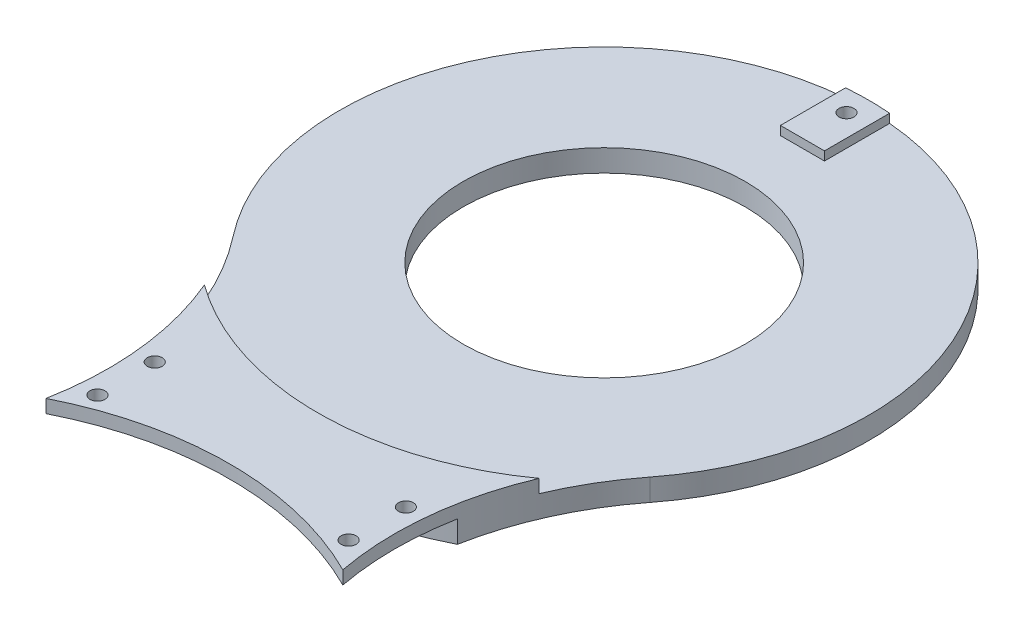
ISO-10303-21;
HEADER;
FILE_DESCRIPTION(('STEP AP214'),'2;1');
FILE_NAME('part.step','',(''),(''),'','','');
FILE_SCHEMA(('AUTOMOTIVE_DESIGN { 1 0 10303 214 1 1 1 1 }'));
ENDSEC;
DATA;
#1=APPLICATION_CONTEXT('core data for automotive mechanical design processes');
#2=APPLICATION_PROTOCOL_DEFINITION('international standard','automotive_design',2000,#1);
#3=PRODUCT_CONTEXT('',#1,'mechanical');
#4=PRODUCT('Part','Part','',(#3));
#5=PRODUCT_RELATED_PRODUCT_CATEGORY('part','',(#4));
#6=PRODUCT_DEFINITION_FORMATION('','',#4);
#7=PRODUCT_DEFINITION_CONTEXT('part definition',#1,'design');
#8=PRODUCT_DEFINITION('design','',#6,#7);
#9=PRODUCT_DEFINITION_SHAPE('','',#8);
#10=(LENGTH_UNIT() NAMED_UNIT(*) SI_UNIT(.MILLI.,.METRE.));
#11=(NAMED_UNIT(*) PLANE_ANGLE_UNIT() SI_UNIT($,.RADIAN.));
#12=(NAMED_UNIT(*) SI_UNIT($,.STERADIAN.) SOLID_ANGLE_UNIT());
#13=UNCERTAINTY_MEASURE_WITH_UNIT(LENGTH_MEASURE(1.E-05),#10,'distance_accuracy_value','');
#14=(GEOMETRIC_REPRESENTATION_CONTEXT(3) GLOBAL_UNCERTAINTY_ASSIGNED_CONTEXT((#13)) GLOBAL_UNIT_ASSIGNED_CONTEXT((#10,
#11,#12)) REPRESENTATION_CONTEXT('',''));
#15=CARTESIAN_POINT('',(0.,0.,0.));
#16=DIRECTION('',(0.,0.,1.));
#17=DIRECTION('',(1.,0.,0.));
#18=AXIS2_PLACEMENT_3D('',#15,#16,#17);
#19=CARTESIAN_POINT('',(51.234753829798,5.,-40.));
#20=DIRECTION('',(0.,1.,0.));
#21=DIRECTION('',(0.,0.,1.));
#22=AXIS2_PLACEMENT_3D('',#19,#20,#21);
#23=PLANE('',#22);
#24=CARTESIAN_POINT('',(0.,5.,-160.));
#25=DIRECTION('',(0.,1.,0.));
#26=DIRECTION('',(0.,0.,1.));
#27=AXIS2_PLACEMENT_3D('',#24,#25,#26);
#28=CIRCLE('',#27,32.);
#29=CARTESIAN_POINT('',(0.,5.,-128.));
#30=VERTEX_POINT('',#29);
#31=EDGE_CURVE('E199',#30,#30,#28,.T.);
#32=ORIENTED_EDGE('',*,*,#31,.F.);
#33=EDGE_LOOP('',(#32));
#34=FACE_BOUND('',#33,.T.);
#35=CARTESIAN_POINT('',(-102.469507659596,5.,-80.));
#36=DIRECTION('',(0.,-1.,0.));
#37=DIRECTION('',(0.,0.,1.));
#38=AXIS2_PLACEMENT_3D('',#35,#36,#37);
#39=CIRCLE('',#38,70.);
#40=CARTESIAN_POINT('',(-47.2936189198135,5.,-123.076923076923));
#41=VERTEX_POINT('',#40);
#42=CARTESIAN_POINT('',(-37.9965134730589,5.,-107.262300354569));
#43=VERTEX_POINT('',#42);
#44=EDGE_CURVE('E211',#41,#43,#39,.T.);
#45=ORIENTED_EDGE('',*,*,#44,.T.);
#46=CARTESIAN_POINT('',(0.,5.,-160.));
#47=DIRECTION('',(0.,-1.,0.));
#48=DIRECTION('',(0.,0.,1.));
#49=AXIS2_PLACEMENT_3D('',#46,#47,#48);
#50=CIRCLE('',#49,65.);
#51=CARTESIAN_POINT('',(37.9965134730589,5.,-107.262300354569));
#52=VERTEX_POINT('',#51);
#53=EDGE_CURVE('E274',#52,#43,#50,.T.);
#54=ORIENTED_EDGE('',*,*,#53,.F.);
#55=CARTESIAN_POINT('',(102.469507659596,5.,-80.));
#56=DIRECTION('',(0.,-1.,0.));
#57=DIRECTION('',(0.,0.,1.));
#58=AXIS2_PLACEMENT_3D('',#55,#56,#57);
#59=CIRCLE('',#58,70.);
#60=CARTESIAN_POINT('',(47.2936189198135,5.,-123.076923076923));
#61=VERTEX_POINT('',#60);
#62=EDGE_CURVE('E205',#52,#61,#59,.T.);
#63=ORIENTED_EDGE('',*,*,#62,.T.);
#64=CARTESIAN_POINT('',(0.,5.,-160.));
#65=DIRECTION('',(0.,1.,0.));
#66=DIRECTION('',(0.,0.,1.));
#67=AXIS2_PLACEMENT_3D('',#64,#65,#66);
#68=CIRCLE('',#67,60.);
#69=CARTESIAN_POINT('',(5.,5.,-219.791303715507));
#70=VERTEX_POINT('',#69);
#71=EDGE_CURVE('E209',#61,#70,#68,.T.);
#72=ORIENTED_EDGE('',*,*,#71,.T.);
#73=DIRECTION('',(0.,0.,-1.));
#74=VECTOR('',#73,1.);
#75=CARTESIAN_POINT('',(5.,5.,-205.));
#76=LINE('',#75,#74);
#77=CARTESIAN_POINT('',(5.,5.,-205.));
#78=VERTEX_POINT('',#77);
#79=EDGE_CURVE('E59',#78,#70,#76,.T.);
#80=ORIENTED_EDGE('',*,*,#79,.F.);
#81=DIRECTION('',(1.,0.,0.));
#82=VECTOR('',#81,1.);
#83=CARTESIAN_POINT('',(5.,5.,-205.));
#84=LINE('',#83,#82);
#85=CARTESIAN_POINT('',(-5.,5.,-205.));
#86=VERTEX_POINT('',#85);
#87=EDGE_CURVE('E175',#86,#78,#84,.T.);
#88=ORIENTED_EDGE('',*,*,#87,.F.);
#89=DIRECTION('',(0.,0.,1.));
#90=VECTOR('',#89,1.);
#91=CARTESIAN_POINT('',(-5.,5.,-205.));
#92=LINE('',#91,#90);
#93=CARTESIAN_POINT('',(-5.,5.,-219.791303715507));
#94=VERTEX_POINT('',#93);
#95=EDGE_CURVE('E183',#94,#86,#92,.T.);
#96=ORIENTED_EDGE('',*,*,#95,.F.);
#97=EDGE_CURVE('E207',#94,#41,#68,.T.);
#98=ORIENTED_EDGE('',*,*,#97,.T.);
#99=EDGE_LOOP('',(#45,#54,#63,#72,#80,#88,#96,#98));
#100=FACE_BOUND('',#99,.T.);
#101=ADVANCED_FACE('F36',(#34,#100),#23,.T.);
#102=CARTESIAN_POINT('',(51.234753829798,0.,-40.));
#103=DIRECTION('',(0.,1.,0.));
#104=DIRECTION('',(0.,0.,1.));
#105=AXIS2_PLACEMENT_3D('',#102,#103,#104);
#106=PLANE('',#105);
#107=CARTESIAN_POINT('',(0.,0.,-160.));
#108=DIRECTION('',(0.,1.,0.));
#109=DIRECTION('',(0.,0.,1.));
#110=AXIS2_PLACEMENT_3D('',#107,#108,#109);
#111=CIRCLE('',#110,32.);
#112=CARTESIAN_POINT('',(0.,0.,-128.));
#113=VERTEX_POINT('',#112);
#114=EDGE_CURVE('E198',#113,#113,#111,.T.);
#115=ORIENTED_EDGE('',*,*,#114,.T.);
#116=EDGE_LOOP('',(#115));
#117=FACE_BOUND('',#116,.T.);
#118=CARTESIAN_POINT('',(0.,0.,-215.));
#119=DIRECTION('',(0.,-1.,0.));
#120=DIRECTION('',(0.,0.,-1.));
#121=AXIS2_PLACEMENT_3D('',#118,#119,#120);
#122=CIRCLE('',#121,2.95);
#123=CARTESIAN_POINT('',(0.,0.,-217.95));
#124=VERTEX_POINT('',#123);
#125=EDGE_CURVE('E161',#124,#124,#122,.T.);
#126=ORIENTED_EDGE('',*,*,#125,.F.);
#127=EDGE_LOOP('',(#126));
#128=FACE_BOUND('',#127,.T.);
#129=CARTESIAN_POINT('',(102.469507659596,0.,-80.));
#130=DIRECTION('',(0.,-1.,0.));
#131=DIRECTION('',(0.,0.,1.));
#132=AXIS2_PLACEMENT_3D('',#129,#130,#131);
#133=CIRCLE('',#132,70.);
#134=CARTESIAN_POINT('',(33.6854203746086,0.,-92.9903555136583));
#135=VERTEX_POINT('',#134);
#136=CARTESIAN_POINT('',(47.2936189198135,0.,-123.076923076923));
#137=VERTEX_POINT('',#136);
#138=EDGE_CURVE('E202',#135,#137,#133,.T.);
#139=ORIENTED_EDGE('',*,*,#138,.F.);
#140=CARTESIAN_POINT('',(0.,0.,-160.));
#141=DIRECTION('',(0.,1.,0.));
#142=DIRECTION('',(0.,0.,-1.));
#143=AXIS2_PLACEMENT_3D('',#140,#141,#142);
#144=CIRCLE('',#143,75.);
#145=CARTESIAN_POINT('',(-33.6854203746086,0.,-92.9903555136583));
#146=VERTEX_POINT('',#145);
#147=EDGE_CURVE('E149',#146,#135,#144,.T.);
#148=ORIENTED_EDGE('',*,*,#147,.F.);
#149=CARTESIAN_POINT('',(-102.469507659596,0.,-80.));
#150=DIRECTION('',(0.,-1.,0.));
#151=DIRECTION('',(0.,0.,1.));
#152=AXIS2_PLACEMENT_3D('',#149,#150,#151);
#153=CIRCLE('',#152,70.);
#154=CARTESIAN_POINT('',(-47.2936189198135,0.,-123.076923076923));
#155=VERTEX_POINT('',#154);
#156=EDGE_CURVE('E208',#155,#146,#153,.T.);
#157=ORIENTED_EDGE('',*,*,#156,.F.);
#158=CARTESIAN_POINT('',(0.,0.,-160.));
#159=DIRECTION('',(0.,1.,0.));
#160=DIRECTION('',(0.,0.,1.));
#161=AXIS2_PLACEMENT_3D('',#158,#159,#160);
#162=CIRCLE('',#161,60.);
#163=EDGE_CURVE('E216',#137,#155,#162,.T.);
#164=ORIENTED_EDGE('',*,*,#163,.F.);
#165=EDGE_LOOP('',(#139,#148,#157,#164));
#166=FACE_BOUND('',#165,.T.);
#167=ADVANCED_FACE('F230',(#117,#128,#166),#106,.F.);
#168=CARTESIAN_POINT('',(0.,-12.,-215.));
#169=DIRECTION('',(0.,1.,0.));
#170=DIRECTION('',(0.,0.,1.));
#171=AXIS2_PLACEMENT_3D('',#168,#169,#170);
#172=CYLINDRICAL_SURFACE('',#171,1.7);
#173=CARTESIAN_POINT('',(0.,7.,-215.));
#174=DIRECTION('',(0.,1.,0.));
#175=DIRECTION('',(0.,0.,1.));
#176=AXIS2_PLACEMENT_3D('',#173,#174,#175);
#177=CIRCLE('',#176,1.7);
#178=CARTESIAN_POINT('',(0.,7.,-213.3));
#179=VERTEX_POINT('',#178);
#180=EDGE_CURVE('E168',#179,#179,#177,.T.);
#181=ORIENTED_EDGE('',*,*,#180,.T.);
#182=EDGE_LOOP('',(#181));
#183=FACE_BOUND('',#182,.T.);
#184=CARTESIAN_POINT('',(0.,3.,-215.));
#185=DIRECTION('',(0.,-1.,0.));
#186=DIRECTION('',(0.,0.,-1.));
#187=AXIS2_PLACEMENT_3D('',#184,#185,#186);
#188=CIRCLE('',#187,1.7);
#189=CARTESIAN_POINT('',(0.,3.,-216.7));
#190=VERTEX_POINT('',#189);
#191=EDGE_CURVE('E165',#190,#190,#188,.F.);
#192=ORIENTED_EDGE('',*,*,#191,.F.);
#193=EDGE_LOOP('',(#192));
#194=FACE_BOUND('',#193,.T.);
#195=ADVANCED_FACE('F228',(#183,#194),#172,.F.);
#196=CARTESIAN_POINT('',(102.469507659596,5.,-80.));
#197=DIRECTION('',(0.,-1.,0.));
#198=DIRECTION('',(0.,0.,-1.));
#199=AXIS2_PLACEMENT_3D('',#196,#197,#198);
#200=CYLINDRICAL_SURFACE('',#199,70.);
#201=ORIENTED_EDGE('',*,*,#62,.F.);
#202=DIRECTION('',(0.,-1.,0.));
#203=VECTOR('',#202,1.);
#204=CARTESIAN_POINT('',(37.9965134730589,8.,-107.262300354569));
#205=LINE('',#204,#203);
#206=CARTESIAN_POINT('',(37.9965134730589,8.,-107.262300354569));
#207=VERTEX_POINT('',#206);
#208=EDGE_CURVE('E132',#207,#52,#205,.T.);
#209=ORIENTED_EDGE('',*,*,#208,.F.);
#210=CARTESIAN_POINT('',(102.469507659596,8.,-80.));
#211=DIRECTION('',(0.,-1.,0.));
#212=DIRECTION('',(0.,0.,1.));
#213=AXIS2_PLACEMENT_3D('',#210,#211,#212);
#214=CIRCLE('',#213,70.);
#215=CARTESIAN_POINT('',(33.6854203746086,8.,-67.0096444863417));
#216=VERTEX_POINT('',#215);
#217=EDGE_CURVE('E125',#216,#207,#214,.T.);
#218=ORIENTED_EDGE('',*,*,#217,.F.);
#219=DIRECTION('',(0.,-1.,0.));
#220=VECTOR('',#219,1.);
#221=CARTESIAN_POINT('',(33.6854203746086,8.,-67.0096444863417));
#222=LINE('',#221,#220);
#223=CARTESIAN_POINT('',(33.6854203746086,5.,-67.0096444863417));
#224=VERTEX_POINT('',#223);
#225=EDGE_CURVE('E130',#216,#224,#222,.T.);
#226=ORIENTED_EDGE('',*,*,#225,.T.);
#227=CARTESIAN_POINT('',(102.469507659596,5.,-80.));
#228=DIRECTION('',(0.,-1.,0.));
#229=DIRECTION('',(0.,0.,1.));
#230=AXIS2_PLACEMENT_3D('',#227,#228,#229);
#231=CIRCLE('',#230,70.);
#232=CARTESIAN_POINT('',(33.6854203746086,5.,-92.9903555136583));
#233=VERTEX_POINT('',#232);
#234=EDGE_CURVE('E273',#224,#233,#231,.T.);
#235=ORIENTED_EDGE('',*,*,#234,.T.);
#236=DIRECTION('',(0.,-1.,0.));
#237=VECTOR('',#236,1.);
#238=CARTESIAN_POINT('',(33.6854203746086,18.5,-92.9903555136583));
#239=LINE('',#238,#237);
#240=EDGE_CURVE('E158',#233,#135,#239,.T.);
#241=ORIENTED_EDGE('',*,*,#240,.T.);
#242=ORIENTED_EDGE('',*,*,#138,.T.);
#243=DIRECTION('',(0.,-1.,0.));
#244=VECTOR('',#243,1.);
#245=CARTESIAN_POINT('',(47.2936189198135,5.,-123.076923076923));
#246=LINE('',#245,#244);
#247=EDGE_CURVE('E44',#61,#137,#246,.T.);
#248=ORIENTED_EDGE('',*,*,#247,.F.);
#249=EDGE_LOOP('',(#201,#209,#218,#226,#235,#241,#242,#248));
#250=FACE_BOUND('',#249,.T.);
#251=ADVANCED_FACE('F38',(#250),#200,.F.);
#252=CARTESIAN_POINT('',(0.,5.,-160.));
#253=DIRECTION('',(0.,-1.,0.));
#254=DIRECTION('',(0.,0.,-1.));
#255=AXIS2_PLACEMENT_3D('',#252,#253,#254);
#256=CYLINDRICAL_SURFACE('',#255,60.);
#257=ORIENTED_EDGE('',*,*,#163,.T.);
#258=DIRECTION('',(0.,-1.,0.));
#259=VECTOR('',#258,1.);
#260=CARTESIAN_POINT('',(-47.2936189198135,5.,-123.076923076923));
#261=LINE('',#260,#259);
#262=EDGE_CURVE('E214',#41,#155,#261,.T.);
#263=ORIENTED_EDGE('',*,*,#262,.F.);
#264=ORIENTED_EDGE('',*,*,#97,.F.);
#265=DIRECTION('',(0.,-1.,0.));
#266=VECTOR('',#265,1.);
#267=CARTESIAN_POINT('',(-5.,7.,-219.791303715507));
#268=LINE('',#267,#266);
#269=CARTESIAN_POINT('',(-5.,7.,-219.791303715507));
#270=VERTEX_POINT('',#269);
#271=EDGE_CURVE('E192',#270,#94,#268,.T.);
#272=ORIENTED_EDGE('',*,*,#271,.F.);
#273=CARTESIAN_POINT('',(0.,7.,-160.));
#274=DIRECTION('',(0.,1.,0.));
#275=DIRECTION('',(0.,0.,1.));
#276=AXIS2_PLACEMENT_3D('',#273,#274,#275);
#277=CIRCLE('',#276,60.);
#278=CARTESIAN_POINT('',(5.00000000000001,7.,-219.791303715507));
#279=VERTEX_POINT('',#278);
#280=EDGE_CURVE('E174',#279,#270,#277,.T.);
#281=ORIENTED_EDGE('',*,*,#280,.F.);
#282=DIRECTION('',(0.,-1.,0.));
#283=VECTOR('',#282,1.);
#284=CARTESIAN_POINT('',(5.00000000000001,7.,-219.791303715507));
#285=LINE('',#284,#283);
#286=EDGE_CURVE('E195',#279,#70,#285,.T.);
#287=ORIENTED_EDGE('',*,*,#286,.T.);
#288=ORIENTED_EDGE('',*,*,#71,.F.);
#289=ORIENTED_EDGE('',*,*,#247,.T.);
#290=EDGE_LOOP('',(#257,#263,#264,#272,#281,#287,#288,#289));
#291=FACE_BOUND('',#290,.T.);
#292=ADVANCED_FACE('F237',(#291),#256,.T.);
#293=CARTESIAN_POINT('',(-102.469507659596,5.,-80.));
#294=DIRECTION('',(0.,-1.,0.));
#295=DIRECTION('',(0.,0.,-1.));
#296=AXIS2_PLACEMENT_3D('',#293,#294,#295);
#297=CYLINDRICAL_SURFACE('',#296,70.);
#298=ORIENTED_EDGE('',*,*,#156,.T.);
#299=DIRECTION('',(0.,-1.,0.));
#300=VECTOR('',#299,1.);
#301=CARTESIAN_POINT('',(-33.6854203746086,18.5,-92.9903555136583));
#302=LINE('',#301,#300);
#303=CARTESIAN_POINT('',(-33.6854203746086,5.,-92.9903555136583));
#304=VERTEX_POINT('',#303);
#305=EDGE_CURVE('E11',#146,#304,#302,.F.);
#306=ORIENTED_EDGE('',*,*,#305,.T.);
#307=CARTESIAN_POINT('',(-102.469507659596,5.,-80.));
#308=DIRECTION('',(0.,-1.,0.));
#309=DIRECTION('',(0.,0.,1.));
#310=AXIS2_PLACEMENT_3D('',#307,#308,#309);
#311=CIRCLE('',#310,70.);
#312=CARTESIAN_POINT('',(-33.6854203746086,5.,-67.0096444863417));
#313=VERTEX_POINT('',#312);
#314=EDGE_CURVE('E51',#304,#313,#311,.T.);
#315=ORIENTED_EDGE('',*,*,#314,.T.);
#316=DIRECTION('',(0.,-1.,0.));
#317=VECTOR('',#316,1.);
#318=CARTESIAN_POINT('',(-33.6854203746086,8.,-67.0096444863417));
#319=LINE('',#318,#317);
#320=CARTESIAN_POINT('',(-33.6854203746086,8.,-67.0096444863417));
#321=VERTEX_POINT('',#320);
#322=EDGE_CURVE('E282',#321,#313,#319,.T.);
#323=ORIENTED_EDGE('',*,*,#322,.F.);
#324=CARTESIAN_POINT('',(-102.469507659596,8.,-80.));
#325=DIRECTION('',(0.,-1.,0.));
#326=DIRECTION('',(0.,0.,1.));
#327=AXIS2_PLACEMENT_3D('',#324,#325,#326);
#328=CIRCLE('',#327,70.);
#329=CARTESIAN_POINT('',(-37.9965134730589,8.,-107.262300354569));
#330=VERTEX_POINT('',#329);
#331=EDGE_CURVE('E142',#330,#321,#328,.T.);
#332=ORIENTED_EDGE('',*,*,#331,.F.);
#333=DIRECTION('',(0.,-1.,0.));
#334=VECTOR('',#333,1.);
#335=CARTESIAN_POINT('',(-37.9965134730589,8.,-107.262300354569));
#336=LINE('',#335,#334);
#337=EDGE_CURVE('E153',#330,#43,#336,.T.);
#338=ORIENTED_EDGE('',*,*,#337,.T.);
#339=ORIENTED_EDGE('',*,*,#44,.F.);
#340=ORIENTED_EDGE('',*,*,#262,.T.);
#341=EDGE_LOOP('',(#298,#306,#315,#323,#332,#338,#339,#340));
#342=FACE_BOUND('',#341,.T.);
#343=ADVANCED_FACE('F252',(#342),#297,.F.);
#344=CARTESIAN_POINT('',(0.,5.,-160.));
#345=DIRECTION('',(0.,-1.,0.));
#346=DIRECTION('',(0.,0.,-1.));
#347=AXIS2_PLACEMENT_3D('',#344,#345,#346);
#348=CYLINDRICAL_SURFACE('',#347,32.);
#349=ORIENTED_EDGE('',*,*,#31,.T.);
#350=EDGE_LOOP('',(#349));
#351=FACE_BOUND('',#350,.T.);
#352=ORIENTED_EDGE('',*,*,#114,.F.);
#353=EDGE_LOOP('',(#352));
#354=FACE_BOUND('',#353,.T.);
#355=ADVANCED_FACE('F249',(#351,#354),#348,.F.);
#356=CARTESIAN_POINT('',(5.,7.,-205.));
#357=DIRECTION('',(-1.,0.,0.));
#358=DIRECTION('',(0.,0.,1.));
#359=AXIS2_PLACEMENT_3D('',#356,#357,#358);
#360=PLANE('',#359);
#361=ORIENTED_EDGE('',*,*,#79,.T.);
#362=ORIENTED_EDGE('',*,*,#286,.F.);
#363=DIRECTION('',(0.,0.,-1.));
#364=VECTOR('',#363,1.);
#365=CARTESIAN_POINT('',(5.,7.,-205.));
#366=LINE('',#365,#364);
#367=CARTESIAN_POINT('',(5.,7.,-205.));
#368=VERTEX_POINT('',#367);
#369=EDGE_CURVE('E171',#368,#279,#366,.T.);
#370=ORIENTED_EDGE('',*,*,#369,.F.);
#371=DIRECTION('',(0.,-1.,0.));
#372=VECTOR('',#371,1.);
#373=CARTESIAN_POINT('',(5.,7.,-205.));
#374=LINE('',#373,#372);
#375=EDGE_CURVE('E181',#368,#78,#374,.T.);
#376=ORIENTED_EDGE('',*,*,#375,.T.);
#377=EDGE_LOOP('',(#361,#362,#370,#376));
#378=FACE_BOUND('',#377,.T.);
#379=ADVANCED_FACE('F298',(#378),#360,.F.);
#380=CARTESIAN_POINT('',(-5.,7.,-205.));
#381=DIRECTION('',(1.,0.,0.));
#382=DIRECTION('',(0.,0.,-1.));
#383=AXIS2_PLACEMENT_3D('',#380,#381,#382);
#384=PLANE('',#383);
#385=ORIENTED_EDGE('',*,*,#95,.T.);
#386=DIRECTION('',(0.,-1.,0.));
#387=VECTOR('',#386,1.);
#388=CARTESIAN_POINT('',(-5.,7.,-205.));
#389=LINE('',#388,#387);
#390=CARTESIAN_POINT('',(-5.,7.,-205.));
#391=VERTEX_POINT('',#390);
#392=EDGE_CURVE('E189',#391,#86,#389,.T.);
#393=ORIENTED_EDGE('',*,*,#392,.F.);
#394=DIRECTION('',(0.,0.,1.));
#395=VECTOR('',#394,1.);
#396=CARTESIAN_POINT('',(-5.,7.,-205.));
#397=LINE('',#396,#395);
#398=EDGE_CURVE('E177',#270,#391,#397,.T.);
#399=ORIENTED_EDGE('',*,*,#398,.F.);
#400=ORIENTED_EDGE('',*,*,#271,.T.);
#401=EDGE_LOOP('',(#385,#393,#399,#400));
#402=FACE_BOUND('',#401,.T.);
#403=ADVANCED_FACE('F289',(#402),#384,.F.);
#404=CARTESIAN_POINT('',(5.,7.,-205.));
#405=DIRECTION('',(0.,0.,-1.));
#406=DIRECTION('',(-1.,0.,0.));
#407=AXIS2_PLACEMENT_3D('',#404,#405,#406);
#408=PLANE('',#407);
#409=ORIENTED_EDGE('',*,*,#87,.T.);
#410=ORIENTED_EDGE('',*,*,#375,.F.);
#411=DIRECTION('',(1.,0.,0.));
#412=VECTOR('',#411,1.);
#413=CARTESIAN_POINT('',(5.,7.,-205.));
#414=LINE('',#413,#412);
#415=EDGE_CURVE('E179',#391,#368,#414,.T.);
#416=ORIENTED_EDGE('',*,*,#415,.F.);
#417=ORIENTED_EDGE('',*,*,#392,.T.);
#418=EDGE_LOOP('',(#409,#410,#416,#417));
#419=FACE_BOUND('',#418,.T.);
#420=ADVANCED_FACE('F300',(#419),#408,.F.);
#421=CARTESIAN_POINT('',(0.,7.,-160.));
#422=DIRECTION('',(0.,1.,0.));
#423=DIRECTION('',(0.,0.,1.));
#424=AXIS2_PLACEMENT_3D('',#421,#422,#423);
#425=PLANE('',#424);
#426=ORIENTED_EDGE('',*,*,#180,.F.);
#427=EDGE_LOOP('',(#426));
#428=FACE_BOUND('',#427,.T.);
#429=ORIENTED_EDGE('',*,*,#369,.T.);
#430=ORIENTED_EDGE('',*,*,#280,.T.);
#431=ORIENTED_EDGE('',*,*,#398,.T.);
#432=ORIENTED_EDGE('',*,*,#415,.T.);
#433=EDGE_LOOP('',(#429,#430,#431,#432));
#434=FACE_BOUND('',#433,.T.);
#435=ADVANCED_FACE('F293',(#428,#434),#425,.T.);
#436=CARTESIAN_POINT('',(0.,3.,-215.));
#437=DIRECTION('',(0.,-1.,0.));
#438=DIRECTION('',(0.,0.,-1.));
#439=AXIS2_PLACEMENT_3D('',#436,#437,#438);
#440=PLANE('',#439);
#441=CARTESIAN_POINT('',(0.,3.,-215.));
#442=DIRECTION('',(0.,-1.,0.));
#443=DIRECTION('',(0.,0.,-1.));
#444=AXIS2_PLACEMENT_3D('',#441,#442,#443);
#445=CIRCLE('',#444,2.95);
#446=CARTESIAN_POINT('',(0.,3.,-217.95));
#447=VERTEX_POINT('',#446);
#448=EDGE_CURVE('E162',#447,#447,#445,.T.);
#449=ORIENTED_EDGE('',*,*,#448,.T.);
#450=EDGE_LOOP('',(#449));
#451=FACE_BOUND('',#450,.T.);
#452=ORIENTED_EDGE('',*,*,#191,.T.);
#453=EDGE_LOOP('',(#452));
#454=FACE_BOUND('',#453,.T.);
#455=ADVANCED_FACE('F226',(#451,#454),#440,.T.);
#456=CARTESIAN_POINT('',(0.,3.,-215.));
#457=DIRECTION('',(0.,-1.,0.));
#458=DIRECTION('',(0.,0.,-1.));
#459=AXIS2_PLACEMENT_3D('',#456,#457,#458);
#460=CYLINDRICAL_SURFACE('',#459,2.95);
#461=ORIENTED_EDGE('',*,*,#448,.F.);
#462=EDGE_LOOP('',(#461));
#463=FACE_BOUND('',#462,.T.);
#464=ORIENTED_EDGE('',*,*,#125,.T.);
#465=EDGE_LOOP('',(#464));
#466=FACE_BOUND('',#465,.T.);
#467=ADVANCED_FACE('F321',(#463,#466),#460,.F.);
#468=CARTESIAN_POINT('',(0.,37.,-160.));
#469=DIRECTION('',(0.,-1.,0.));
#470=DIRECTION('',(0.,0.,-1.));
#471=AXIS2_PLACEMENT_3D('',#468,#469,#470);
#472=CYLINDRICAL_SURFACE('',#471,75.);
#473=CARTESIAN_POINT('',(0.,5.,-160.));
#474=DIRECTION('',(0.,1.,0.));
#475=DIRECTION('',(0.,0.,1.));
#476=AXIS2_PLACEMENT_3D('',#473,#474,#475);
#477=CIRCLE('',#476,75.);
#478=EDGE_CURVE('E151',#233,#304,#477,.F.);
#479=ORIENTED_EDGE('',*,*,#478,.T.);
#480=ORIENTED_EDGE('',*,*,#305,.F.);
#481=ORIENTED_EDGE('',*,*,#147,.T.);
#482=ORIENTED_EDGE('',*,*,#240,.F.);
#483=EDGE_LOOP('',(#479,#480,#481,#482));
#484=FACE_BOUND('',#483,.T.);
#485=ADVANCED_FACE('F272',(#484),#472,.T.);
#486=CARTESIAN_POINT('',(-51.234753829798,8.,-40.));
#487=DIRECTION('',(0.,1.,0.));
#488=DIRECTION('',(0.,0.,1.));
#489=AXIS2_PLACEMENT_3D('',#486,#487,#488);
#490=PLANE('',#489);
#491=CARTESIAN_POINT('',(28.5,8.,-73.5));
#492=DIRECTION('',(0.,1.,0.));
#493=DIRECTION('',(0.,0.,1.));
#494=AXIS2_PLACEMENT_3D('',#491,#492,#493);
#495=CIRCLE('',#494,1.70000000000001);
#496=CARTESIAN_POINT('',(28.5,8.,-71.8));
#497=VERTEX_POINT('',#496);
#498=EDGE_CURVE('E373',#497,#497,#495,.T.);
#499=ORIENTED_EDGE('',*,*,#498,.F.);
#500=EDGE_LOOP('',(#499));
#501=FACE_BOUND('',#500,.T.);
#502=CARTESIAN_POINT('',(-28.5,8.,-86.5));
#503=DIRECTION('',(0.,1.,0.));
#504=DIRECTION('',(0.,0.,1.));
#505=AXIS2_PLACEMENT_3D('',#502,#503,#504);
#506=CIRCLE('',#505,1.70000000000001);
#507=CARTESIAN_POINT('',(-28.5,8.,-84.8));
#508=VERTEX_POINT('',#507);
#509=EDGE_CURVE('E277',#508,#508,#506,.T.);
#510=ORIENTED_EDGE('',*,*,#509,.F.);
#511=EDGE_LOOP('',(#510));
#512=FACE_BOUND('',#511,.T.);
#513=CARTESIAN_POINT('',(0.,8.,0.));
#514=DIRECTION('',(0.,-1.,0.));
#515=DIRECTION('',(0.,0.,1.));
#516=AXIS2_PLACEMENT_3D('',#513,#514,#515);
#517=CIRCLE('',#516,75.);
#518=EDGE_CURVE('E136',#321,#216,#517,.T.);
#519=ORIENTED_EDGE('',*,*,#518,.T.);
#520=ORIENTED_EDGE('',*,*,#217,.T.);
#521=CARTESIAN_POINT('',(0.,8.,-160.));
#522=DIRECTION('',(0.,-1.,0.));
#523=DIRECTION('',(0.,0.,1.));
#524=AXIS2_PLACEMENT_3D('',#521,#522,#523);
#525=CIRCLE('',#524,65.);
#526=EDGE_CURVE('E135',#207,#330,#525,.T.);
#527=ORIENTED_EDGE('',*,*,#526,.T.);
#528=ORIENTED_EDGE('',*,*,#331,.T.);
#529=EDGE_LOOP('',(#519,#520,#527,#528));
#530=FACE_BOUND('',#529,.T.);
#531=CARTESIAN_POINT('',(-28.5,8.,-73.5));
#532=DIRECTION('',(0.,1.,0.));
#533=DIRECTION('',(0.,0.,1.));
#534=AXIS2_PLACEMENT_3D('',#531,#532,#533);
#535=CIRCLE('',#534,1.70000000000001);
#536=CARTESIAN_POINT('',(-28.5,8.,-71.8));
#537=VERTEX_POINT('',#536);
#538=EDGE_CURVE('E379',#537,#537,#535,.T.);
#539=ORIENTED_EDGE('',*,*,#538,.F.);
#540=EDGE_LOOP('',(#539));
#541=FACE_BOUND('',#540,.T.);
#542=CARTESIAN_POINT('',(28.5,8.,-86.5));
#543=DIRECTION('',(0.,1.,0.));
#544=DIRECTION('',(0.,0.,1.));
#545=AXIS2_PLACEMENT_3D('',#542,#543,#544);
#546=CIRCLE('',#545,1.70000000000001);
#547=CARTESIAN_POINT('',(28.5,8.,-84.8));
#548=VERTEX_POINT('',#547);
#549=EDGE_CURVE('E364',#548,#548,#546,.T.);
#550=ORIENTED_EDGE('',*,*,#549,.F.);
#551=EDGE_LOOP('',(#550));
#552=FACE_BOUND('',#551,.T.);
#553=ADVANCED_FACE('F139',(#501,#512,#530,#541,#552),#490,.T.);
#554=CARTESIAN_POINT('',(-51.234753829798,5.,-40.));
#555=DIRECTION('',(0.,1.,0.));
#556=DIRECTION('',(0.,0.,1.));
#557=AXIS2_PLACEMENT_3D('',#554,#555,#556);
#558=PLANE('',#557);
#559=ORIENTED_EDGE('',*,*,#314,.F.);
#560=ORIENTED_EDGE('',*,*,#478,.F.);
#561=ORIENTED_EDGE('',*,*,#234,.F.);
#562=CARTESIAN_POINT('',(0.,5.,0.));
#563=DIRECTION('',(0.,-1.,0.));
#564=DIRECTION('',(0.,0.,1.));
#565=AXIS2_PLACEMENT_3D('',#562,#563,#564);
#566=CIRCLE('',#565,75.);
#567=EDGE_CURVE('E148',#313,#224,#566,.T.);
#568=ORIENTED_EDGE('',*,*,#567,.F.);
#569=EDGE_LOOP('',(#559,#560,#561,#568));
#570=FACE_BOUND('',#569,.T.);
#571=CARTESIAN_POINT('',(-28.5,5.,-86.5));
#572=DIRECTION('',(0.,1.,0.));
#573=DIRECTION('',(0.,0.,1.));
#574=AXIS2_PLACEMENT_3D('',#571,#572,#573);
#575=CIRCLE('',#574,1.70000000000001);
#576=CARTESIAN_POINT('',(-28.5,5.,-84.8));
#577=VERTEX_POINT('',#576);
#578=EDGE_CURVE('E382',#577,#577,#575,.T.);
#579=ORIENTED_EDGE('',*,*,#578,.T.);
#580=EDGE_LOOP('',(#579));
#581=FACE_BOUND('',#580,.T.);
#582=CARTESIAN_POINT('',(-28.5,5.,-73.5));
#583=DIRECTION('',(0.,1.,0.));
#584=DIRECTION('',(0.,0.,1.));
#585=AXIS2_PLACEMENT_3D('',#582,#583,#584);
#586=CIRCLE('',#585,1.70000000000001);
#587=CARTESIAN_POINT('',(-28.5,5.,-71.8));
#588=VERTEX_POINT('',#587);
#589=EDGE_CURVE('E376',#588,#588,#586,.T.);
#590=ORIENTED_EDGE('',*,*,#589,.T.);
#591=EDGE_LOOP('',(#590));
#592=FACE_BOUND('',#591,.T.);
#593=CARTESIAN_POINT('',(28.5,5.,-73.5));
#594=DIRECTION('',(0.,1.,0.));
#595=DIRECTION('',(0.,0.,1.));
#596=AXIS2_PLACEMENT_3D('',#593,#594,#595);
#597=CIRCLE('',#596,1.70000000000001);
#598=CARTESIAN_POINT('',(28.5,5.,-71.8));
#599=VERTEX_POINT('',#598);
#600=EDGE_CURVE('E370',#599,#599,#597,.T.);
#601=ORIENTED_EDGE('',*,*,#600,.T.);
#602=EDGE_LOOP('',(#601));
#603=FACE_BOUND('',#602,.T.);
#604=CARTESIAN_POINT('',(28.5,5.,-86.5));
#605=DIRECTION('',(0.,1.,0.));
#606=DIRECTION('',(0.,0.,1.));
#607=AXIS2_PLACEMENT_3D('',#604,#605,#606);
#608=CIRCLE('',#607,1.70000000000001);
#609=CARTESIAN_POINT('',(28.5,5.,-84.8));
#610=VERTEX_POINT('',#609);
#611=EDGE_CURVE('E367',#610,#610,#608,.T.);
#612=ORIENTED_EDGE('',*,*,#611,.T.);
#613=EDGE_LOOP('',(#612));
#614=FACE_BOUND('',#613,.T.);
#615=ADVANCED_FACE('F336',(#570,#581,#592,#603,#614),#558,.F.);
#616=CARTESIAN_POINT('',(0.,8.,0.));
#617=DIRECTION('',(0.,-1.,0.));
#618=DIRECTION('',(0.,0.,-1.));
#619=AXIS2_PLACEMENT_3D('',#616,#617,#618);
#620=CYLINDRICAL_SURFACE('',#619,75.);
#621=ORIENTED_EDGE('',*,*,#567,.T.);
#622=ORIENTED_EDGE('',*,*,#225,.F.);
#623=ORIENTED_EDGE('',*,*,#518,.F.);
#624=ORIENTED_EDGE('',*,*,#322,.T.);
#625=EDGE_LOOP('',(#621,#622,#623,#624));
#626=FACE_BOUND('',#625,.T.);
#627=ADVANCED_FACE('F147',(#626),#620,.F.);
#628=CARTESIAN_POINT('',(0.,8.,-160.));
#629=DIRECTION('',(0.,-1.,0.));
#630=DIRECTION('',(0.,0.,-1.));
#631=AXIS2_PLACEMENT_3D('',#628,#629,#630);
#632=CYLINDRICAL_SURFACE('',#631,65.);
#633=ORIENTED_EDGE('',*,*,#53,.T.);
#634=ORIENTED_EDGE('',*,*,#337,.F.);
#635=ORIENTED_EDGE('',*,*,#526,.F.);
#636=ORIENTED_EDGE('',*,*,#208,.T.);
#637=EDGE_LOOP('',(#633,#634,#635,#636));
#638=FACE_BOUND('',#637,.T.);
#639=ADVANCED_FACE('F335',(#638),#632,.F.);
#640=CARTESIAN_POINT('',(-28.5,8.,-86.5));
#641=DIRECTION('',(0.,-1.,0.));
#642=DIRECTION('',(0.,0.,-1.));
#643=AXIS2_PLACEMENT_3D('',#640,#641,#642);
#644=CYLINDRICAL_SURFACE('',#643,1.70000000000001);
#645=ORIENTED_EDGE('',*,*,#509,.T.);
#646=EDGE_LOOP('',(#645));
#647=FACE_BOUND('',#646,.T.);
#648=ORIENTED_EDGE('',*,*,#578,.F.);
#649=EDGE_LOOP('',(#648));
#650=FACE_BOUND('',#649,.T.);
#651=ADVANCED_FACE('F339',(#647,#650),#644,.F.);
#652=CARTESIAN_POINT('',(-28.5,8.,-73.5));
#653=DIRECTION('',(0.,-1.,0.));
#654=DIRECTION('',(0.,0.,-1.));
#655=AXIS2_PLACEMENT_3D('',#652,#653,#654);
#656=CYLINDRICAL_SURFACE('',#655,1.70000000000001);
#657=ORIENTED_EDGE('',*,*,#538,.T.);
#658=EDGE_LOOP('',(#657));
#659=FACE_BOUND('',#658,.T.);
#660=ORIENTED_EDGE('',*,*,#589,.F.);
#661=EDGE_LOOP('',(#660));
#662=FACE_BOUND('',#661,.T.);
#663=ADVANCED_FACE('F347',(#659,#662),#656,.F.);
#664=CARTESIAN_POINT('',(28.5,8.,-73.5));
#665=DIRECTION('',(0.,-1.,0.));
#666=DIRECTION('',(0.,0.,-1.));
#667=AXIS2_PLACEMENT_3D('',#664,#665,#666);
#668=CYLINDRICAL_SURFACE('',#667,1.70000000000001);
#669=ORIENTED_EDGE('',*,*,#498,.T.);
#670=EDGE_LOOP('',(#669));
#671=FACE_BOUND('',#670,.T.);
#672=ORIENTED_EDGE('',*,*,#600,.F.);
#673=EDGE_LOOP('',(#672));
#674=FACE_BOUND('',#673,.T.);
#675=ADVANCED_FACE('F351',(#671,#674),#668,.F.);
#676=CARTESIAN_POINT('',(28.5,8.,-86.5));
#677=DIRECTION('',(0.,-1.,0.));
#678=DIRECTION('',(0.,0.,-1.));
#679=AXIS2_PLACEMENT_3D('',#676,#677,#678);
#680=CYLINDRICAL_SURFACE('',#679,1.70000000000001);
#681=ORIENTED_EDGE('',*,*,#549,.T.);
#682=EDGE_LOOP('',(#681));
#683=FACE_BOUND('',#682,.T.);
#684=ORIENTED_EDGE('',*,*,#611,.F.);
#685=EDGE_LOOP('',(#684));
#686=FACE_BOUND('',#685,.T.);
#687=ADVANCED_FACE('F355',(#683,#686),#680,.F.);
#688=CLOSED_SHELL('',(#101,#167,#195,#251,#292,#343,#355,#379,#403,#420,#435,#455,#467,#485,
#553,#615,#627,#639,#651,#663,#675,#687));
#689=MANIFOLD_SOLID_BREP('B2',#688);
#690=ADVANCED_BREP_SHAPE_REPRESENTATION('',(#18,#689),#14);
#691=SHAPE_DEFINITION_REPRESENTATION(#9,#690);
ENDSEC;
END-ISO-10303-21;
